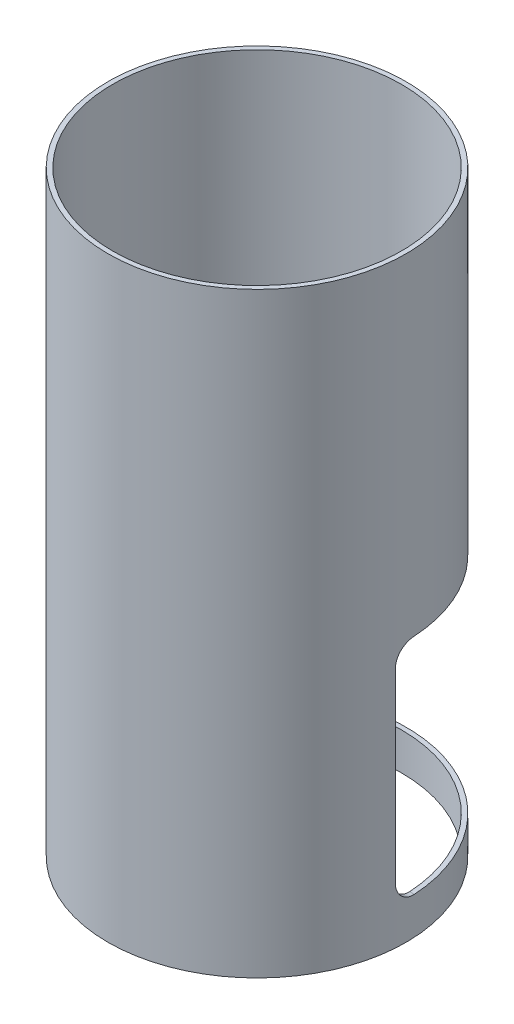
ISO-10303-21;
HEADER;
FILE_DESCRIPTION(('STEP AP214'),'2;1');
FILE_NAME('part.step','',(''),(''),'','','');
FILE_SCHEMA(('AUTOMOTIVE_DESIGN { 1 0 10303 214 1 1 1 1 }'));
ENDSEC;
DATA;
#1=APPLICATION_CONTEXT('core data for automotive mechanical design processes');
#2=APPLICATION_PROTOCOL_DEFINITION('international standard','automotive_design',2000,#1);
#3=PRODUCT_CONTEXT('',#1,'mechanical');
#4=PRODUCT('Part','Part','',(#3));
#5=PRODUCT_RELATED_PRODUCT_CATEGORY('part','',(#4));
#6=PRODUCT_DEFINITION_FORMATION('','',#4);
#7=PRODUCT_DEFINITION_CONTEXT('part definition',#1,'design');
#8=PRODUCT_DEFINITION('design','',#6,#7);
#9=PRODUCT_DEFINITION_SHAPE('','',#8);
#10=(LENGTH_UNIT() NAMED_UNIT(*) SI_UNIT(.MILLI.,.METRE.));
#11=(NAMED_UNIT(*) PLANE_ANGLE_UNIT() SI_UNIT($,.RADIAN.));
#12=(NAMED_UNIT(*) SI_UNIT($,.STERADIAN.) SOLID_ANGLE_UNIT());
#13=UNCERTAINTY_MEASURE_WITH_UNIT(LENGTH_MEASURE(1.E-05),#10,'distance_accuracy_value','');
#14=(GEOMETRIC_REPRESENTATION_CONTEXT(3) GLOBAL_UNCERTAINTY_ASSIGNED_CONTEXT((#13)) GLOBAL_UNIT_ASSIGNED_CONTEXT((#10,
#11,#12)) REPRESENTATION_CONTEXT('',''));
#15=CARTESIAN_POINT('',(0.,0.,0.));
#16=DIRECTION('',(0.,0.,1.));
#17=DIRECTION('',(1.,0.,0.));
#18=AXIS2_PLACEMENT_3D('',#15,#16,#17);
#19=CARTESIAN_POINT('',(0.,406.4,0.));
#20=DIRECTION('',(0.,1.,0.));
#21=DIRECTION('',(0.,0.,1.));
#22=AXIS2_PLACEMENT_3D('',#19,#20,#21);
#23=PLANE('',#22);
#24=CARTESIAN_POINT('',(0.,406.4,0.));
#25=DIRECTION('',(0.,1.,0.));
#26=DIRECTION('',(0.,0.,1.));
#27=AXIS2_PLACEMENT_3D('',#24,#25,#26);
#28=CIRCLE('',#27,101.6);
#29=CARTESIAN_POINT('',(0.,406.4,101.6));
#30=VERTEX_POINT('',#29);
#31=EDGE_CURVE('E136',#30,#30,#28,.T.);
#32=ORIENTED_EDGE('',*,*,#31,.T.);
#33=EDGE_LOOP('',(#32));
#34=FACE_BOUND('',#33,.T.);
#35=CARTESIAN_POINT('',(0.,406.4,0.));
#36=DIRECTION('',(0.,1.,0.));
#37=DIRECTION('',(0.,0.,1.));
#38=AXIS2_PLACEMENT_3D('',#35,#36,#37);
#39=CIRCLE('',#38,98.425);
#40=CARTESIAN_POINT('',(0.,406.4,98.425));
#41=VERTEX_POINT('',#40);
#42=EDGE_CURVE('E235',#41,#41,#39,.T.);
#43=ORIENTED_EDGE('',*,*,#42,.F.);
#44=EDGE_LOOP('',(#43));
#45=FACE_BOUND('',#44,.T.);
#46=ADVANCED_FACE('F39',(#34,#45),#23,.T.);
#47=CARTESIAN_POINT('',(0.,0.,0.));
#48=DIRECTION('',(0.,1.,0.));
#49=DIRECTION('',(0.,0.,1.));
#50=AXIS2_PLACEMENT_3D('',#47,#48,#49);
#51=PLANE('',#50);
#52=CARTESIAN_POINT('',(0.,0.,0.));
#53=DIRECTION('',(0.,1.,0.));
#54=DIRECTION('',(0.,0.,1.));
#55=AXIS2_PLACEMENT_3D('',#52,#53,#54);
#56=CIRCLE('',#55,101.6);
#57=CARTESIAN_POINT('',(0.,0.,101.6));
#58=VERTEX_POINT('',#57);
#59=EDGE_CURVE('E141',#58,#58,#56,.T.);
#60=ORIENTED_EDGE('',*,*,#59,.F.);
#61=EDGE_LOOP('',(#60));
#62=FACE_BOUND('',#61,.T.);
#63=CARTESIAN_POINT('',(0.,0.,0.));
#64=DIRECTION('',(0.,1.,0.));
#65=DIRECTION('',(0.,0.,1.));
#66=AXIS2_PLACEMENT_3D('',#63,#64,#65);
#67=CIRCLE('',#66,98.425);
#68=CARTESIAN_POINT('',(0.,0.,98.425));
#69=VERTEX_POINT('',#68);
#70=EDGE_CURVE('E232',#69,#69,#67,.T.);
#71=ORIENTED_EDGE('',*,*,#70,.T.);
#72=EDGE_LOOP('',(#71));
#73=FACE_BOUND('',#72,.T.);
#74=ADVANCED_FACE('F245',(#62,#73),#51,.F.);
#75=CARTESIAN_POINT('',(0.,406.4,0.));
#76=DIRECTION('',(0.,-1.,0.));
#77=DIRECTION('',(0.,0.,-1.));
#78=AXIS2_PLACEMENT_3D('',#75,#76,#77);
#79=CYLINDRICAL_SURFACE('',#78,101.6);
#80=DIRECTION('',(0.,-1.,0.));
#81=VECTOR('',#80,1.);
#82=CARTESIAN_POINT('',(101.352507506398,177.8,7.0872577324035));
#83=LINE('',#82,#81);
#84=CARTESIAN_POINT('',(101.352507506398,165.1,7.0872577324035));
#85=VERTEX_POINT('',#84);
#86=CARTESIAN_POINT('',(101.352507506398,38.1000000000001,7.0872577324035));
#87=VERTEX_POINT('',#86);
#88=EDGE_CURVE('E131',#85,#87,#83,.T.);
#89=ORIENTED_EDGE('',*,*,#88,.F.);
#90=CARTESIAN_POINT('',(101.352507506398,165.1,7.0872577324035));
#91=CARTESIAN_POINT('',(101.352490680105,165.457145711755,7.08729503529065));
#92=CARTESIAN_POINT('',(101.353557853474,165.814285914696,7.07223068436696));
#93=CARTESIAN_POINT('',(101.357738604548,166.526012081259,7.0121680785598));
#94=CARTESIAN_POINT('',(101.360852085439,166.880598164919,6.96717123982882));
#95=CARTESIAN_POINT('',(101.369000908904,167.584450688851,6.84755659702855));
#96=CARTESIAN_POINT('',(101.374034849857,167.933720816036,6.77296039407447));
#97=CARTESIAN_POINT('',(101.385789336181,168.624721514362,6.59467575024478));
#98=CARTESIAN_POINT('',(101.392509860944,168.966452177575,6.49098766484647));
#99=CARTESIAN_POINT('',(101.407330688748,169.640117750323,6.25517540473336));
#100=CARTESIAN_POINT('',(101.415431675931,169.97204770657,6.12303712180545));
#101=CARTESIAN_POINT('',(101.432625869236,170.623572347981,5.83127382370409));
#102=CARTESIAN_POINT('',(101.441719074595,170.943167042617,5.67164882963567));
#103=CARTESIAN_POINT('',(101.460450835278,171.567692534275,5.32605301537648));
#104=CARTESIAN_POINT('',(101.470089298308,171.872625796881,5.14008664586342));
#105=CARTESIAN_POINT('',(101.489421043065,172.465710833294,4.74308905799296));
#106=CARTESIAN_POINT('',(101.499114324457,172.753862709487,4.53205799258293));
#107=CARTESIAN_POINT('',(101.518026386225,173.311146290048,4.08656009304685));
#108=CARTESIAN_POINT('',(101.52724547585,173.580290434373,3.85210883392709));
#109=CARTESIAN_POINT('',(101.544679270725,174.097849583408,3.36130781304116));
#110=CARTESIAN_POINT('',(101.55289397125,174.346264490607,3.10495794827525));
#111=CARTESIAN_POINT('',(101.567785695279,174.820625983605,2.57214446746383));
#112=CARTESIAN_POINT('',(101.574462504866,175.046569441209,2.2956780602954));
#113=CARTESIAN_POINT('',(101.585762448801,175.474338927299,1.72464490901471));
#114=CARTESIAN_POINT('',(101.590385618321,175.676165368803,1.43007847500752));
#115=CARTESIAN_POINT('',(101.597092624483,176.053796153326,0.825733138629053));
#116=CARTESIAN_POINT('',(101.599182925293,176.229665728394,0.515995069276033));
#117=CARTESIAN_POINT('',(101.600425660314,176.554778225901,-0.117158431350992));
#118=CARTESIAN_POINT('',(101.599578070693,176.70402093234,-0.440573973551779));
#119=CARTESIAN_POINT('',(101.594592131139,176.974814937986,-1.09864532448756));
#120=CARTESIAN_POINT('',(101.59045500717,177.096376531861,-1.43329690121104));
#121=CARTESIAN_POINT('',(101.578625080404,177.311053176135,-2.11140284865901));
#122=CARTESIAN_POINT('',(101.570933088515,177.404174706003,-2.45485519495734));
#123=CARTESIAN_POINT('',(101.548526079264,177.588332354327,-3.26695272091826));
#124=CARTESIAN_POINT('',(101.532309232997,177.667776809299,-3.73826465716463));
#125=CARTESIAN_POINT('',(101.502830200809,177.74714043693,-4.4487994877028));
#126=CARTESIAN_POINT('',(101.49215277868,177.766961156985,-4.68609667339186));
#127=CARTESIAN_POINT('',(101.469092342687,177.793390907594,-5.1613892389719));
#128=CARTESIAN_POINT('',(101.456709001795,177.799997401175,-5.39938474414999));
#129=CARTESIAN_POINT('',(101.443480822077,177.8,-5.63739289929005));
#130=B_SPLINE_CURVE_WITH_KNOTS('',3,(#90,#91,#92,#93,#94,#95,#96,#97,#98,#99,#100,#101,#102,
#103,#104,#105,#106,#107,#108,#109,#110,#111,#112,#113,#114,#115,#116,#117,#118,#119,#120,#121,
#122,#123,#124,#125,#126,#127,#128,#129),.UNSPECIFIED.,.F.,.F.,(4,2,2,2,2,2,2,2,2,2,2,2,2,2,2,2,
2,2,2,4),(0.,1.07111020816663,2.1421697440494,3.21244907217267,4.28271532299071,
5.35351353725705,6.42431092933955,7.4949276132491,8.56553776448018,9.63544061443254,
10.7053484969324,11.7754051107428,12.8454433965412,13.9127450320036,14.9800553251362,
16.046968032514,17.1136374846756,18.5448903135323,19.2596666782446,19.9745802583073),.UNSPECIFIED.);
#131=CARTESIAN_POINT('',(101.443480822077,177.8,-5.63739289929006));
#132=VERTEX_POINT('',#131);
#133=EDGE_CURVE('E53',#85,#132,#130,.T.);
#134=ORIENTED_EDGE('',*,*,#133,.T.);
#135=CARTESIAN_POINT('',(0.,177.8,0.));
#136=DIRECTION('',(0.,1.,0.));
#137=DIRECTION('',(0.,0.,1.));
#138=AXIS2_PLACEMENT_3D('',#135,#136,#137);
#139=CIRCLE('',#138,101.6);
#140=CARTESIAN_POINT('',(-101.443480822077,177.8,-5.63739289929006));
#141=VERTEX_POINT('',#140);
#142=EDGE_CURVE('E115',#132,#141,#139,.T.);
#143=ORIENTED_EDGE('',*,*,#142,.T.);
#144=CARTESIAN_POINT('',(-101.443480822077,177.8,-5.63739289929006));
#145=CARTESIAN_POINT('',(-101.463304318896,177.800039069962,-5.28101074959956));
#146=CARTESIAN_POINT('',(-101.481213332903,177.785189316922,-4.92451825425865));
#147=CARTESIAN_POINT('',(-101.513196800821,177.725870463819,-4.21383249727284));
#148=CARTESIAN_POINT('',(-101.527271244402,177.681401283958,-3.85963924182487));
#149=CARTESIAN_POINT('',(-101.551572059362,177.563039921353,-3.15629990412808));
#150=CARTESIAN_POINT('',(-101.561800897827,177.48916666516,-2.80715072467401));
#151=CARTESIAN_POINT('',(-101.578546584507,177.312439686108,-2.11618399513467));
#152=CARTESIAN_POINT('',(-101.585063538039,177.209586785601,-1.77436623730259));
#153=CARTESIAN_POINT('',(-101.594601989376,176.975462059296,-1.10026700487742));
#154=CARTESIAN_POINT('',(-101.597620866012,176.84416901012,-0.767992863050888));
#155=CARTESIAN_POINT('',(-101.600457773882,176.554088593483,-0.115656989504371));
#156=CARTESIAN_POINT('',(-101.600275811019,176.395301276728,0.204404764737226));
#157=CARTESIAN_POINT('',(-101.597091723552,176.051369371343,0.829919660992572));
#158=CARTESIAN_POINT('',(-101.594090304819,175.866231389626,1.13537643934836));
#159=CARTESIAN_POINT('',(-101.585712185619,175.470868112356,1.72955985099311));
#160=CARTESIAN_POINT('',(-101.580335507065,175.260643048254,2.01828663859453));
#161=CARTESIAN_POINT('',(-101.567724800087,174.817502768789,2.57579592301461));
#162=CARTESIAN_POINT('',(-101.560498455684,174.584683840953,2.84465513918334));
#163=CARTESIAN_POINT('',(-101.544695038223,174.097283570891,3.36182339568089));
#164=CARTESIAN_POINT('',(-101.5361179615,173.842702169633,3.61013238026211));
#165=CARTESIAN_POINT('',(-101.518142112432,173.313518903318,4.08450639764461));
#166=CARTESIAN_POINT('',(-101.508743152751,173.038912476246,4.31056633402936));
#167=CARTESIAN_POINT('',(-101.489653582352,172.471679077097,4.73879402899632));
#168=CARTESIAN_POINT('',(-101.479962975238,172.179052327774,4.94096208282351));
#169=CARTESIAN_POINT('',(-101.460779690977,171.577259898905,5.32037147042846));
#170=CARTESIAN_POINT('',(-101.451287434448,171.268063224448,5.49756366760062));
#171=CARTESIAN_POINT('',(-101.432995354641,170.635847827433,5.82532453211955));
#172=CARTESIAN_POINT('',(-101.424195538585,170.312828960754,5.97589292178117));
#173=CARTESIAN_POINT('',(-101.407716649044,169.655387843722,6.24930230321614));
#174=CARTESIAN_POINT('',(-101.400037082344,169.320970692227,6.3721555103583));
#175=CARTESIAN_POINT('',(-101.386154787376,168.64310906164,6.58934081551105));
#176=CARTESIAN_POINT('',(-101.379951723254,168.299666655274,6.6836794009856));
#177=CARTESIAN_POINT('',(-101.367456788158,167.485180741489,6.87099739083214));
#178=CARTESIAN_POINT('',(-101.361884613855,167.011308111906,6.95208875834734));
#179=CARTESIAN_POINT('',(-101.356277830897,166.296515569402,7.03317504777537));
#180=CARTESIAN_POINT('',(-101.354867502864,166.057715058771,7.05344533059619));
#181=CARTESIAN_POINT('',(-101.352981299351,165.579297289201,7.08048667541715));
#182=CARTESIAN_POINT('',(-101.352505618409,165.339679870623,7.08725492707371));
#183=CARTESIAN_POINT('',(-101.352507506398,165.1,7.08725773240349));
#184=B_SPLINE_CURVE_WITH_KNOTS('',3,(#144,#145,#146,#147,#148,#149,#150,#151,#152,#153,#154,
#155,#156,#157,#158,#159,#160,#161,#162,#163,#164,#165,#166,#167,#168,#169,#170,#171,#172,#173,
#174,#175,#176,#177,#178,#179,#180,#181,#182,#183),.UNSPECIFIED.,.F.,.F.,(4,2,2,2,2,2,2,2,2,2,2,
2,2,2,2,2,2,2,2,4),(0.,1.07049125834571,2.14098540069004,3.21079160842633,4.28056746144515,
5.35114439881777,6.42171936177898,7.49202637032659,8.56232350510861,9.62824452152936,
10.6941684294305,11.7603359347369,12.8264902634545,13.894713673364,14.9629482241407,
16.0307110304491,17.0982307230337,18.5370921201497,19.2557615180968,19.9745804859318),.UNSPECIFIED.);
#185=CARTESIAN_POINT('',(-101.352507506398,165.1,7.0872577324035));
#186=VERTEX_POINT('',#185);
#187=EDGE_CURVE('E109',#141,#186,#184,.T.);
#188=ORIENTED_EDGE('',*,*,#187,.T.);
#189=DIRECTION('',(0.,-1.,0.));
#190=VECTOR('',#189,1.);
#191=CARTESIAN_POINT('',(-101.352507506398,177.8,7.0872577324035));
#192=LINE('',#191,#190);
#193=CARTESIAN_POINT('',(-101.352507506398,38.1000000000001,7.0872577324035));
#194=VERTEX_POINT('',#193);
#195=EDGE_CURVE('E113',#186,#194,#192,.T.);
#196=ORIENTED_EDGE('',*,*,#195,.T.);
#197=CARTESIAN_POINT('',(-101.352507506398,38.1,7.0872577324035));
#198=CARTESIAN_POINT('',(-101.352490680105,37.7428542882449,7.08729503529065));
#199=CARTESIAN_POINT('',(-101.353557853474,37.385714085304,7.07223068436696));
#200=CARTESIAN_POINT('',(-101.357738604548,36.6739879187407,7.0121680785598));
#201=CARTESIAN_POINT('',(-101.360852085439,36.319401835081,6.96717123982882));
#202=CARTESIAN_POINT('',(-101.369000908904,35.6155493111487,6.84755659702855));
#203=CARTESIAN_POINT('',(-101.374034849857,35.266279183964,6.77296039407447));
#204=CARTESIAN_POINT('',(-101.385789336181,34.5752784856376,6.59467575024479));
#205=CARTESIAN_POINT('',(-101.392509860944,34.2335478224254,6.49098766484648));
#206=CARTESIAN_POINT('',(-101.407330688748,33.5598822496768,6.25517540473336));
#207=CARTESIAN_POINT('',(-101.415431675931,33.22795229343,6.12303712180546));
#208=CARTESIAN_POINT('',(-101.432625869236,32.5764276520186,5.8312738237041));
#209=CARTESIAN_POINT('',(-101.441719074595,32.2568329573829,5.67164882963567));
#210=CARTESIAN_POINT('',(-101.460450835278,31.6323074657246,5.32605301537649));
#211=CARTESIAN_POINT('',(-101.470089298308,31.3273742031192,5.14008664586343));
#212=CARTESIAN_POINT('',(-101.489421043065,30.7342891667062,4.74308905799297));
#213=CARTESIAN_POINT('',(-101.499114324457,30.4461372905129,4.53205799258294));
#214=CARTESIAN_POINT('',(-101.518026386225,29.8888537099518,4.08656009304685));
#215=CARTESIAN_POINT('',(-101.52724547585,29.619709565627,3.85210883392711));
#216=CARTESIAN_POINT('',(-101.544679270725,29.1021504165923,3.36130781304117));
#217=CARTESIAN_POINT('',(-101.55289397125,28.8537355093927,3.10495794827526));
#218=CARTESIAN_POINT('',(-101.567785695279,28.3793740163951,2.57214446746383));
#219=CARTESIAN_POINT('',(-101.574462504866,28.1534305587906,2.29567806029541));
#220=CARTESIAN_POINT('',(-101.585762448801,27.7256610727011,1.72464490901472));
#221=CARTESIAN_POINT('',(-101.590385618321,27.5238346311971,1.43007847500752));
#222=CARTESIAN_POINT('',(-101.597092624483,27.1462038466743,0.825733138629051));
#223=CARTESIAN_POINT('',(-101.599182925293,26.9703342716059,0.515995069276032));
#224=CARTESIAN_POINT('',(-101.600425660314,26.645221774099,-0.117158431350995));
#225=CARTESIAN_POINT('',(-101.599578070693,26.4959790676603,-0.440573973551784));
#226=CARTESIAN_POINT('',(-101.594592131139,26.2251850620145,-1.09864532448756));
#227=CARTESIAN_POINT('',(-101.59045500717,26.103623468139,-1.43329690121104));
#228=CARTESIAN_POINT('',(-101.578625080404,25.8889468238651,-2.11140284865902));
#229=CARTESIAN_POINT('',(-101.570933088515,25.7958252939974,-2.45485519495734));
#230=CARTESIAN_POINT('',(-101.548526079264,25.6116676456728,-3.26695272091826));
#231=CARTESIAN_POINT('',(-101.532309232997,25.532223190701,-3.73826465716463));
#232=CARTESIAN_POINT('',(-101.502830200809,25.4528595630697,-4.4487994877028));
#233=CARTESIAN_POINT('',(-101.49215277868,25.4330388430154,-4.68609667339187));
#234=CARTESIAN_POINT('',(-101.469092342687,25.4066090924062,-5.1613892389719));
#235=CARTESIAN_POINT('',(-101.456709001795,25.4000025988249,-5.39938474415));
#236=CARTESIAN_POINT('',(-101.443480822077,25.4,-5.63739289929006));
#237=B_SPLINE_CURVE_WITH_KNOTS('',3,(#197,#198,#199,#200,#201,#202,#203,#204,#205,#206,#207,
#208,#209,#210,#211,#212,#213,#214,#215,#216,#217,#218,#219,#220,#221,#222,#223,#224,#225,#226,
#227,#228,#229,#230,#231,#232,#233,#234,#235,#236),.UNSPECIFIED.,.F.,.F.,(4,2,2,2,2,2,2,2,2,2,2,
2,2,2,2,2,2,2,2,4),(0.,1.07111020816662,2.14216974404938,3.21244907217265,4.2827153229907,
5.35351353725703,6.42431092933952,7.49492761324908,8.56553776448015,9.63544061443252,
10.7053484969323,11.7754051107428,12.8454433965412,13.9127450320036,14.9800553251362,
16.046968032514,17.1136374846756,18.5448903135323,19.2596666782446,19.9745802583073),.UNSPECIFIED.);
#238=CARTESIAN_POINT('',(-101.443480822077,25.4,-5.63739289929006));
#239=VERTEX_POINT('',#238);
#240=EDGE_CURVE('E157',#194,#239,#237,.T.);
#241=ORIENTED_EDGE('',*,*,#240,.T.);
#242=CARTESIAN_POINT('',(0.,25.4,0.));
#243=DIRECTION('',(0.,1.,0.));
#244=DIRECTION('',(0.,0.,1.));
#245=AXIS2_PLACEMENT_3D('',#242,#243,#244);
#246=CIRCLE('',#245,101.6);
#247=CARTESIAN_POINT('',(101.443480822077,25.4,-5.63739289929006));
#248=VERTEX_POINT('',#247);
#249=EDGE_CURVE('E346',#248,#239,#246,.T.);
#250=ORIENTED_EDGE('',*,*,#249,.F.);
#251=CARTESIAN_POINT('',(101.443480822077,25.4,-5.63739289929006));
#252=CARTESIAN_POINT('',(101.463304318896,25.3999609300383,-5.28101074959956));
#253=CARTESIAN_POINT('',(101.481213332903,25.4148106830776,-4.92451825425865));
#254=CARTESIAN_POINT('',(101.513196800821,25.4741295361808,-4.21383249727284));
#255=CARTESIAN_POINT('',(101.527271244402,25.5185987160418,-3.85963924182487));
#256=CARTESIAN_POINT('',(101.551572059362,25.6369600786465,-3.15629990412808));
#257=CARTESIAN_POINT('',(101.561800897827,25.7108333348399,-2.80715072467401));
#258=CARTESIAN_POINT('',(101.578546584507,25.887560313892,-2.11618399513467));
#259=CARTESIAN_POINT('',(101.585063538039,25.9904132143987,-1.77436623730259));
#260=CARTESIAN_POINT('',(101.594601989376,26.2245379407037,-1.10026700487741));
#261=CARTESIAN_POINT('',(101.597620866012,26.3558309898798,-0.767992863050872));
#262=CARTESIAN_POINT('',(101.600457773882,26.6459114065175,-0.115656989504351));
#263=CARTESIAN_POINT('',(101.600275811019,26.8046987232722,0.204404764737243));
#264=CARTESIAN_POINT('',(101.597091723552,27.1486306286575,0.829919660992589));
#265=CARTESIAN_POINT('',(101.594090304819,27.3337686103743,1.13537643934838));
#266=CARTESIAN_POINT('',(101.585712185619,27.7291318876438,1.72955985099312));
#267=CARTESIAN_POINT('',(101.580335507065,27.9393569517461,2.01828663859454));
#268=CARTESIAN_POINT('',(101.567724800087,28.3824972312108,2.57579592301461));
#269=CARTESIAN_POINT('',(101.560498455684,28.6153161590472,2.84465513918335));
#270=CARTESIAN_POINT('',(101.544695038223,29.1027164291094,3.3618233956809));
#271=CARTESIAN_POINT('',(101.5361179615,29.3572978303674,3.61013238026212));
#272=CARTESIAN_POINT('',(101.518142112432,29.8864810966822,4.08450639764463));
#273=CARTESIAN_POINT('',(101.508743152751,30.1610875237537,4.31056633402938));
#274=CARTESIAN_POINT('',(101.489653582352,30.7283209229033,4.73879402899634));
#275=CARTESIAN_POINT('',(101.479962975238,31.0209476722265,4.94096208282352));
#276=CARTESIAN_POINT('',(101.460779690977,31.6227401010952,5.32037147042847));
#277=CARTESIAN_POINT('',(101.451287434448,31.9319367755524,5.49756366760062));
#278=CARTESIAN_POINT('',(101.432995354641,32.5641521725671,5.82532453211956));
#279=CARTESIAN_POINT('',(101.424195538585,32.8871710392459,5.97589292178117));
#280=CARTESIAN_POINT('',(101.407716649044,33.5446121562784,6.24930230321614));
#281=CARTESIAN_POINT('',(101.400037082344,33.8790293077734,6.3721555103583));
#282=CARTESIAN_POINT('',(101.386154787376,34.5568909383596,6.58934081551105));
#283=CARTESIAN_POINT('',(101.379951723254,34.9003333447259,6.68367940098559));
#284=CARTESIAN_POINT('',(101.367456788158,35.7148192585114,6.87099739083214));
#285=CARTESIAN_POINT('',(101.361884613855,36.1886918880943,6.95208875834735));
#286=CARTESIAN_POINT('',(101.356277830897,36.903484430598,7.03317504777538));
#287=CARTESIAN_POINT('',(101.354867502864,37.1422849412292,7.05344533059619));
#288=CARTESIAN_POINT('',(101.352981299351,37.6207027107994,7.08048667541714));
#289=CARTESIAN_POINT('',(101.352505618409,37.8603201293771,7.08725492707371));
#290=CARTESIAN_POINT('',(101.352507506398,38.1,7.0872577324035));
#291=B_SPLINE_CURVE_WITH_KNOTS('',3,(#251,#252,#253,#254,#255,#256,#257,#258,#259,#260,#261,
#262,#263,#264,#265,#266,#267,#268,#269,#270,#271,#272,#273,#274,#275,#276,#277,#278,#279,#280,
#281,#282,#283,#284,#285,#286,#287,#288,#289,#290),.UNSPECIFIED.,.F.,.F.,(4,2,2,2,2,2,2,2,2,2,2,
2,2,2,2,2,2,2,2,4),(0.,1.07049125834571,2.14098540069004,3.21079160842633,4.28056746144515,
5.3511443988178,6.421719361779,7.4920263703266,8.5623235051086,9.62824452152937,
10.6941684294305,11.7603359347369,12.8264902634545,13.894713673364,14.9629482241407,
16.0307110304491,17.0982307230337,18.5370921201497,19.2557615180968,19.9745804859318),.UNSPECIFIED.);
#292=EDGE_CURVE('E60',#248,#87,#291,.T.);
#293=ORIENTED_EDGE('',*,*,#292,.T.);
#294=EDGE_LOOP('',(#89,#134,#143,#188,#196,#241,#250,#293));
#295=FACE_BOUND('',#294,.T.);
#296=ORIENTED_EDGE('',*,*,#31,.F.);
#297=EDGE_LOOP('',(#296));
#298=FACE_BOUND('',#297,.T.);
#299=ORIENTED_EDGE('',*,*,#59,.T.);
#300=EDGE_LOOP('',(#299));
#301=FACE_BOUND('',#300,.T.);
#302=ADVANCED_FACE('F111',(#295,#298,#301),#79,.T.);
#303=CARTESIAN_POINT('',(0.,406.4,0.));
#304=DIRECTION('',(0.,-1.,0.));
#305=DIRECTION('',(0.,0.,-1.));
#306=AXIS2_PLACEMENT_3D('',#303,#304,#305);
#307=CYLINDRICAL_SURFACE('',#306,98.425);
#308=CARTESIAN_POINT('',(0.,177.8,0.));
#309=DIRECTION('',(0.,1.,0.));
#310=DIRECTION('',(0.,0.,1.));
#311=AXIS2_PLACEMENT_3D('',#308,#309,#310);
#312=CIRCLE('',#311,98.425);
#313=CARTESIAN_POINT('',(98.2503591938578,177.8,-5.86067771489929));
#314=VERTEX_POINT('',#313);
#315=CARTESIAN_POINT('',(-98.2503591938578,177.8,-5.86067771489928));
#316=VERTEX_POINT('',#315);
#317=EDGE_CURVE('E222',#314,#316,#312,.T.);
#318=ORIENTED_EDGE('',*,*,#317,.F.);
#319=CARTESIAN_POINT('',(98.2503591938578,177.8,-5.86067771489928));
#320=CARTESIAN_POINT('',(98.2716308233536,177.800039109309,-5.50439656803708));
#321=CARTESIAN_POINT('',(98.2909269510806,177.785206177048,-5.14799301866223));
#322=CARTESIAN_POINT('',(98.3255565945146,177.725946788467,-4.43745940439693));
#323=CARTESIAN_POINT('',(98.3408900865399,177.681520155294,-4.08332935310583));
#324=CARTESIAN_POINT('',(98.3675741186761,177.563261495093,-3.38008874609604));
#325=CARTESIAN_POINT('',(98.3789271823774,177.489448162857,-3.03097514510128));
#326=CARTESIAN_POINT('',(98.397785142794,177.312852003523,-2.34005701861029));
#327=CARTESIAN_POINT('',(98.4052901527148,177.21007002879,-1.99825227837885));
#328=CARTESIAN_POINT('',(98.4166703097868,176.97609058271,-1.32415344801447));
#329=CARTESIAN_POINT('',(98.4205426725783,176.844871409429,-0.991866842165396));
#330=CARTESIAN_POINT('',(98.4249550867022,176.554938989275,-0.339490325326498));
#331=CARTESIAN_POINT('',(98.4254951446418,176.396225796919,-0.0194003901542068));
#332=CARTESIAN_POINT('',(98.4236303000176,176.052440381717,0.606181158343379));
#333=CARTESIAN_POINT('',(98.42122614934,175.867374899332,0.911676478115657));
#334=CARTESIAN_POINT('',(98.4139272257001,175.472152599629,1.50594545793266));
#335=CARTESIAN_POINT('',(98.409032476336,175.261996020063,1.79471927638441));
#336=CARTESIAN_POINT('',(98.3972812314928,174.819046615044,2.35225384152859));
#337=CARTESIAN_POINT('',(98.3904333710454,174.586356341551,2.62109625772406));
#338=CARTESIAN_POINT('',(98.3752965633528,174.099219496857,3.13824601242546));
#339=CARTESIAN_POINT('',(98.3670076124466,173.844772870388,3.3865532987602));
#340=CARTESIAN_POINT('',(98.3495304510153,173.315863345203,3.86093953816894));
#341=CARTESIAN_POINT('',(98.3403420338055,173.041395849681,4.0870133582667));
#342=CARTESIAN_POINT('',(98.3216089674565,172.474443319933,4.51528449633961));
#343=CARTESIAN_POINT('',(98.3120643226516,172.181958504898,4.71748210469709));
#344=CARTESIAN_POINT('',(98.293120435601,171.580418195411,5.09698815098505));
#345=CARTESIAN_POINT('',(98.2837215318525,171.271329934359,5.27424467308844));
#346=CARTESIAN_POINT('',(98.2655767012571,170.639327973995,5.60214554144258));
#347=CARTESIAN_POINT('',(98.2568307813325,170.316414128172,5.75278960559146));
#348=CARTESIAN_POINT('',(98.2404314863995,169.65917759439,6.02636237006173));
#349=CARTESIAN_POINT('',(98.232777632727,169.324859984931,6.14930322676118));
#350=CARTESIAN_POINT('',(98.2189283095058,168.647191197027,6.36667585659107));
#351=CARTESIAN_POINT('',(98.2127325095371,168.303842084922,6.4611140902768));
#352=CARTESIAN_POINT('',(98.2002302524855,167.488772693876,6.64886280622892));
#353=CARTESIAN_POINT('',(98.1946446408134,167.014198405046,6.73020050762315));
#354=CARTESIAN_POINT('',(98.1890230506216,166.29833329598,6.81153345765535));
#355=CARTESIAN_POINT('',(98.1876086789198,166.059171398477,6.83186548730636));
#356=CARTESIAN_POINT('',(98.1857168966193,165.580027368949,6.85898921119962));
#357=CARTESIAN_POINT('',(98.1852396806995,165.34004507687,6.86577809207525));
#358=CARTESIAN_POINT('',(98.1852416468232,165.1,6.86578092826589));
#359=B_SPLINE_CURVE_WITH_KNOTS('',3,(#319,#320,#321,#322,#323,#324,#325,#326,#327,#328,#329,
#330,#331,#332,#333,#334,#335,#336,#337,#338,#339,#340,#341,#342,#343,#344,#345,#346,#347,#348,
#349,#350,#351,#352,#353,#354,#355,#356,#357,#358),.UNSPECIFIED.,.F.,.F.,(4,2,2,2,2,2,2,2,2,2,2,
2,2,2,2,2,2,2,2,4),(0.,1.07044008433151,2.14088656574488,3.21065315190167,4.28038826488447,
5.35094264250373,6.42149489741283,7.49177381376062,8.56204258942545,9.62765098882547,
10.6932620954085,11.759118641864,12.8249622240439,13.8929925797138,14.9610342562207,
16.0286063512956,17.0959362827863,18.5369806335441,19.2567446136961,19.9766580974238),.UNSPECIFIED.);
#360=CARTESIAN_POINT('',(98.1852416468232,165.1,6.86578092826589));
#361=VERTEX_POINT('',#360);
#362=EDGE_CURVE('E11',#314,#361,#359,.T.);
#363=ORIENTED_EDGE('',*,*,#362,.T.);
#364=DIRECTION('',(0.,-1.,0.));
#365=VECTOR('',#364,1.);
#366=CARTESIAN_POINT('',(98.1852416468232,177.8,6.86578092826589));
#367=LINE('',#366,#365);
#368=CARTESIAN_POINT('',(98.1852416468232,38.1000000000001,6.86578092826589));
#369=VERTEX_POINT('',#368);
#370=EDGE_CURVE('E228',#361,#369,#367,.T.);
#371=ORIENTED_EDGE('',*,*,#370,.T.);
#372=CARTESIAN_POINT('',(98.1852416468232,38.1,6.86578092826589));
#373=CARTESIAN_POINT('',(98.1852243648159,37.7428579075801,6.8658181977252));
#374=CARTESIAN_POINT('',(98.1862919582897,37.3857213234644,6.85075418373783));
#375=CARTESIAN_POINT('',(98.1904720077305,36.6740023021945,6.79069274974572));
#376=CARTESIAN_POINT('',(98.1935843670445,36.3194197451164,6.74569674457799));
#377=CARTESIAN_POINT('',(98.2017261223854,35.6155734961624,6.62608391747099));
#378=CARTESIAN_POINT('',(98.206754123709,35.2663061264471,6.55148864395411));
#379=CARTESIAN_POINT('',(98.2184855478379,34.5753107650612,6.37320555031406));
#380=CARTESIAN_POINT('',(98.2251889501698,34.2335826813163,6.26951808569469));
#381=CARTESIAN_POINT('',(98.2399559854041,33.5599218737531,6.03370610232214));
#382=CARTESIAN_POINT('',(98.2480202936046,33.2279941095209,5.90156745672457));
#383=CARTESIAN_POINT('',(98.2651112686217,32.576473798176,5.60980186392919));
#384=CARTESIAN_POINT('',(98.2741379346373,32.2568812407952,5.45017493961369));
#385=CARTESIAN_POINT('',(98.2926949630539,31.6323600682275,5.10457302411561));
#386=CARTESIAN_POINT('',(98.3022252403582,31.3274289921727,4.91860247542328));
#387=CARTESIAN_POINT('',(98.3212860498772,30.7343488734004,4.52159391564327));
#388=CARTESIAN_POINT('',(98.3308165820901,30.4461997275035,4.31055605869964));
#389=CARTESIAN_POINT('',(98.3493347861753,29.8889345385108,3.86505142988613));
#390=CARTESIAN_POINT('',(98.3583228351092,29.619805252597,3.63060123914825));
#391=CARTESIAN_POINT('',(98.3752130442336,29.1022755773647,3.13980202893722));
#392=CARTESIAN_POINT('',(98.3831151993612,28.8538752846985,2.88345290736801));
#393=CARTESIAN_POINT('',(98.3972871364018,28.3795439537781,2.35064267881174));
#394=CARTESIAN_POINT('',(98.4035566978446,28.1536159527901,2.07417886192117));
#395=CARTESIAN_POINT('',(98.4139353928516,27.7258770520129,1.50315354240798));
#396=CARTESIAN_POINT('',(98.4180445636671,27.524065736429,1.20859235193391));
#397=CARTESIAN_POINT('',(98.423607176832,27.1464980948834,0.604317152858124));
#398=CARTESIAN_POINT('',(98.425067858117,26.9706719588438,0.294646830426171));
#399=CARTESIAN_POINT('',(98.4249272887234,26.6456337609579,-0.338358344992233));
#400=CARTESIAN_POINT('',(98.4233260131565,26.4964219154481,-0.661693309026398));
#401=CARTESIAN_POINT('',(98.4167029789701,26.2256728791442,-1.31959072821588));
#402=CARTESIAN_POINT('',(98.4116824726579,26.1041255778337,-1.65414903013939));
#403=CARTESIAN_POINT('',(98.3979532231811,25.8894575035571,-2.33205182015103));
#404=CARTESIAN_POINT('',(98.3892453181986,25.7963302786993,-2.67539429485536));
#405=CARTESIAN_POINT('',(98.3642823069932,25.6119813666963,-3.48786709735797));
#406=CARTESIAN_POINT('',(98.3464619220411,25.5324143429009,-3.95967404439393));
#407=CARTESIAN_POINT('',(98.3143912013297,25.4529331066175,-4.67093096901615));
#408=CARTESIAN_POINT('',(98.3028194261352,25.433084221552,-4.90846499317322));
#409=CARTESIAN_POINT('',(98.2779097449619,25.4066177175868,-5.38422263297492));
#410=CARTESIAN_POINT('',(98.2645715030197,25.4000026194778,-5.62244637134459));
#411=CARTESIAN_POINT('',(98.2503591938578,25.4,-5.86067771489929));
#412=B_SPLINE_CURVE_WITH_KNOTS('',3,(#372,#373,#374,#375,#376,#377,#378,#379,#380,#381,#382,
#383,#384,#385,#386,#387,#388,#389,#390,#391,#392,#393,#394,#395,#396,#397,#398,#399,#400,#401,
#402,#403,#404,#405,#406,#407,#408,#409,#410,#411),.UNSPECIFIED.,.F.,.F.,(4,2,2,2,2,2,2,2,2,2,2,
2,2,2,2,2,2,2,2,4),(0.,1.07109936064244,2.14214809574101,3.21241852812663,4.28267588247975,
5.35346588149904,6.42425498915547,7.4948637374367,8.56546590266436,9.63531514992617,
10.7051693852558,11.7751680219463,12.8451482081806,13.9121994566448,14.9792593783256,
16.0459286948862,17.1123556770104,18.545291608452,19.2609066093636,19.9766579086765),.UNSPECIFIED.);
#413=CARTESIAN_POINT('',(98.2503591938578,25.4,-5.86067771489929));
#414=VERTEX_POINT('',#413);
#415=EDGE_CURVE('E209',#369,#414,#412,.T.);
#416=ORIENTED_EDGE('',*,*,#415,.T.);
#417=CARTESIAN_POINT('',(0.,25.4,0.));
#418=DIRECTION('',(0.,1.,0.));
#419=DIRECTION('',(0.,0.,1.));
#420=AXIS2_PLACEMENT_3D('',#417,#418,#419);
#421=CIRCLE('',#420,98.425);
#422=CARTESIAN_POINT('',(-98.2503591938578,25.4,-5.86067771489929));
#423=VERTEX_POINT('',#422);
#424=EDGE_CURVE('E342',#414,#423,#421,.T.);
#425=ORIENTED_EDGE('',*,*,#424,.T.);
#426=CARTESIAN_POINT('',(-98.2503591938578,25.4,-5.86067771489928));
#427=CARTESIAN_POINT('',(-98.2716308233536,25.3999608906915,-5.50439656803708));
#428=CARTESIAN_POINT('',(-98.2909269510806,25.4147938229523,-5.14799301866223));
#429=CARTESIAN_POINT('',(-98.3255565945146,25.4740532115325,-4.43745940439692));
#430=CARTESIAN_POINT('',(-98.3408900865399,25.5184798447059,-4.08332935310582));
#431=CARTESIAN_POINT('',(-98.3675741186761,25.6367385049066,-3.38008874609603));
#432=CARTESIAN_POINT('',(-98.3789271823774,25.7105518371433,-3.03097514510128));
#433=CARTESIAN_POINT('',(-98.397785142794,25.887147996477,-2.34005701861028));
#434=CARTESIAN_POINT('',(-98.4052901527148,25.9899299712102,-1.99825227837885));
#435=CARTESIAN_POINT('',(-98.4166703097868,26.2239094172898,-1.32415344801447));
#436=CARTESIAN_POINT('',(-98.4205426725783,26.3551285905713,-0.991866842165384));
#437=CARTESIAN_POINT('',(-98.4249550867022,26.6450610107248,-0.339490325326484));
#438=CARTESIAN_POINT('',(-98.4254951446418,26.8037742030806,-0.0194003901541987));
#439=CARTESIAN_POINT('',(-98.4236303000176,27.1475596182827,0.606181158343389));
#440=CARTESIAN_POINT('',(-98.42122614934,27.3326251006676,0.911676478115675));
#441=CARTESIAN_POINT('',(-98.4139272257001,27.727847400371,1.50594545793268));
#442=CARTESIAN_POINT('',(-98.409032476336,27.9380039799373,1.79471927638442));
#443=CARTESIAN_POINT('',(-98.3972812314928,28.3809533849555,2.35225384152861));
#444=CARTESIAN_POINT('',(-98.3904333710454,28.6136436584495,2.62109625772409));
#445=CARTESIAN_POINT('',(-98.3752965633528,29.1007805031426,3.13824601242549));
#446=CARTESIAN_POINT('',(-98.3670076124466,29.3552271296122,3.38655329876023));
#447=CARTESIAN_POINT('',(-98.3495304510153,29.8841366547974,3.86093953816896));
#448=CARTESIAN_POINT('',(-98.3403420338055,30.1586041503186,4.08701335826672));
#449=CARTESIAN_POINT('',(-98.3216089674565,30.7255566800673,4.51528449633962));
#450=CARTESIAN_POINT('',(-98.3120643226516,31.0180414951024,4.71748210469709));
#451=CARTESIAN_POINT('',(-98.293120435601,31.6195818045895,5.09698815098505));
#452=CARTESIAN_POINT('',(-98.2837215318525,31.9286700656411,5.27424467308844));
#453=CARTESIAN_POINT('',(-98.2655767012571,32.5606720260049,5.60214554144259));
#454=CARTESIAN_POINT('',(-98.2568307813325,32.8835858718284,5.75278960559147));
#455=CARTESIAN_POINT('',(-98.2404314863995,33.5408224056102,6.02636237006173));
#456=CARTESIAN_POINT('',(-98.232777632727,33.8751400150694,6.14930322676119));
#457=CARTESIAN_POINT('',(-98.2189283095058,34.5528088029729,6.36667585659108));
#458=CARTESIAN_POINT('',(-98.2127325095371,34.8961579150782,6.4611140902768));
#459=CARTESIAN_POINT('',(-98.2002302524855,35.7112273061243,6.64886280622892));
#460=CARTESIAN_POINT('',(-98.1946446408134,36.1858015949544,6.73020050762315));
#461=CARTESIAN_POINT('',(-98.1890230506216,36.9016667040202,6.81153345765535));
#462=CARTESIAN_POINT('',(-98.1876086789198,37.1408286015235,6.83186548730637));
#463=CARTESIAN_POINT('',(-98.1857168966193,37.6199726310511,6.85898921119962));
#464=CARTESIAN_POINT('',(-98.1852396806995,37.8599549231296,6.86577809207525));
#465=CARTESIAN_POINT('',(-98.1852416468232,38.1,6.86578092826589));
#466=B_SPLINE_CURVE_WITH_KNOTS('',3,(#426,#427,#428,#429,#430,#431,#432,#433,#434,#435,#436,
#437,#438,#439,#440,#441,#442,#443,#444,#445,#446,#447,#448,#449,#450,#451,#452,#453,#454,#455,
#456,#457,#458,#459,#460,#461,#462,#463,#464,#465),.UNSPECIFIED.,.F.,.F.,(4,2,2,2,2,2,2,2,2,2,2,
2,2,2,2,2,2,2,2,4),(0.,1.07044008433151,2.14088656574489,3.21065315190168,4.28038826488448,
5.35094264250374,6.42149489741284,7.49177381376064,8.56204258942546,9.62765098882553,
10.6932620954086,11.759118641864,12.8249622240439,13.8929925797138,14.9610342562207,
16.0286063512956,17.0959362827863,18.536980633544,19.2567446136961,19.9766580974238),.UNSPECIFIED.);
#467=CARTESIAN_POINT('',(-98.1852416468232,38.1000000000001,6.86578092826589));
#468=VERTEX_POINT('',#467);
#469=EDGE_CURVE('E121',#423,#468,#466,.T.);
#470=ORIENTED_EDGE('',*,*,#469,.T.);
#471=DIRECTION('',(0.,-1.,0.));
#472=VECTOR('',#471,1.);
#473=CARTESIAN_POINT('',(-98.1852416468232,177.8,6.86578092826589));
#474=LINE('',#473,#472);
#475=CARTESIAN_POINT('',(-98.1852416468232,165.1,6.86578092826589));
#476=VERTEX_POINT('',#475);
#477=EDGE_CURVE('E132',#476,#468,#474,.T.);
#478=ORIENTED_EDGE('',*,*,#477,.F.);
#479=CARTESIAN_POINT('',(-98.1852416468232,165.1,6.86578092826589));
#480=CARTESIAN_POINT('',(-98.1852243648159,165.45714209242,6.8658181977252));
#481=CARTESIAN_POINT('',(-98.1862919582897,165.814278676536,6.85075418373783));
#482=CARTESIAN_POINT('',(-98.1904720077305,166.525997697805,6.79069274974572));
#483=CARTESIAN_POINT('',(-98.1935843670445,166.880580254884,6.74569674457799));
#484=CARTESIAN_POINT('',(-98.2017261223854,167.584426503838,6.626083917471));
#485=CARTESIAN_POINT('',(-98.206754123709,167.933693873553,6.55148864395411));
#486=CARTESIAN_POINT('',(-98.2184855478379,168.624689234939,6.37320555031406));
#487=CARTESIAN_POINT('',(-98.2251889501698,168.966417318684,6.26951808569469));
#488=CARTESIAN_POINT('',(-98.2399559854041,169.640078126247,6.03370610232214));
#489=CARTESIAN_POINT('',(-98.2480202936046,169.972005890479,5.90156745672456));
#490=CARTESIAN_POINT('',(-98.2651112686217,170.623526201824,5.60980186392918));
#491=CARTESIAN_POINT('',(-98.2741379346373,170.943118759205,5.45017493961369));
#492=CARTESIAN_POINT('',(-98.2926949630539,171.567639931772,5.1045730241156));
#493=CARTESIAN_POINT('',(-98.3022252403581,171.872571007827,4.91860247542327));
#494=CARTESIAN_POINT('',(-98.3212860498772,172.4656511266,4.52159391564325));
#495=CARTESIAN_POINT('',(-98.3308165820901,172.753800272496,4.31055605869962));
#496=CARTESIAN_POINT('',(-98.3493347861754,173.311065461489,3.8650514298861));
#497=CARTESIAN_POINT('',(-98.3583228351092,173.580194747403,3.63060123914821));
#498=CARTESIAN_POINT('',(-98.3752130442336,174.097724422635,3.13980202893718));
#499=CARTESIAN_POINT('',(-98.3831151993612,174.346124715302,2.88345290736798));
#500=CARTESIAN_POINT('',(-98.3972871364018,174.820456046222,2.35064267881171));
#501=CARTESIAN_POINT('',(-98.4035566978446,175.04638404721,2.07417886192113));
#502=CARTESIAN_POINT('',(-98.4139353928516,175.474122947987,1.50315354240795));
#503=CARTESIAN_POINT('',(-98.4180445636671,175.675934263571,1.20859235193389));
#504=CARTESIAN_POINT('',(-98.423607176832,176.053501905117,0.604317152858116));
#505=CARTESIAN_POINT('',(-98.425067858117,176.229328041156,0.29464683042616));
#506=CARTESIAN_POINT('',(-98.4249272887234,176.554366239042,-0.338358344992246));
#507=CARTESIAN_POINT('',(-98.4233260131565,176.703578084552,-0.661693309026412));
#508=CARTESIAN_POINT('',(-98.4167029789701,176.974327120856,-1.3195907282159));
#509=CARTESIAN_POINT('',(-98.4116824726579,177.095874422166,-1.65414903013941));
#510=CARTESIAN_POINT('',(-98.3979532231811,177.310542496443,-2.33205182015106));
#511=CARTESIAN_POINT('',(-98.3892453181986,177.403669721301,-2.67539429485538));
#512=CARTESIAN_POINT('',(-98.3642823069932,177.588018633304,-3.48786709735798));
#513=CARTESIAN_POINT('',(-98.3464619220411,177.667585657099,-3.95967404439394));
#514=CARTESIAN_POINT('',(-98.3143912013297,177.747066893383,-4.67093096901617));
#515=CARTESIAN_POINT('',(-98.3028194261352,177.766915778448,-4.90846499317323));
#516=CARTESIAN_POINT('',(-98.2779097449619,177.793382282413,-5.38422263297493));
#517=CARTESIAN_POINT('',(-98.2645715030197,177.799997380522,-5.62244637134459));
#518=CARTESIAN_POINT('',(-98.2503591938578,177.8,-5.86067771489929));
#519=B_SPLINE_CURVE_WITH_KNOTS('',3,(#479,#480,#481,#482,#483,#484,#485,#486,#487,#488,#489,
#490,#491,#492,#493,#494,#495,#496,#497,#498,#499,#500,#501,#502,#503,#504,#505,#506,#507,#508,
#509,#510,#511,#512,#513,#514,#515,#516,#517,#518),.UNSPECIFIED.,.F.,.F.,(4,2,2,2,2,2,2,2,2,2,2,
2,2,2,2,2,2,2,2,4),(0.,1.0710993606424,2.142148095741,3.21241852812662,4.28267588247975,
5.35346588149903,6.42425498915549,7.49486373743671,8.56546590266439,9.63531514992624,
10.7051693852558,11.7751680219464,12.8451482081806,13.9121994566448,14.9792593783256,
16.0459286948862,17.1123556770104,18.545291608452,19.2609066093636,19.9766579086765),.UNSPECIFIED.);
#520=EDGE_CURVE('E120',#476,#316,#519,.T.);
#521=ORIENTED_EDGE('',*,*,#520,.T.);
#522=EDGE_LOOP('',(#318,#363,#371,#416,#425,#470,#478,#521));
#523=FACE_BOUND('',#522,.T.);
#524=ORIENTED_EDGE('',*,*,#42,.T.);
#525=EDGE_LOOP('',(#524));
#526=FACE_BOUND('',#525,.T.);
#527=ORIENTED_EDGE('',*,*,#70,.F.);
#528=EDGE_LOOP('',(#527));
#529=FACE_BOUND('',#528,.T.);
#530=ADVANCED_FACE('F198',(#523,#526,#529),#307,.F.);
#531=CARTESIAN_POINT('',(0.,177.8,0.));
#532=DIRECTION('',(0.0697564737441289,0.,-0.997564050259824));
#533=DIRECTION('',(-0.997564050259824,0.,-0.0697564737441289));
#534=AXIS2_PLACEMENT_3D('',#531,#532,#533);
#535=PLANE('',#534);
#536=ORIENTED_EDGE('',*,*,#88,.T.);
#537=DIRECTION('',(0.997564050259824,0.,0.0697564737441289));
#538=VECTOR('',#537,1.);
#539=CARTESIAN_POINT('',(98.1852416468232,38.1,6.86578092826589));
#540=LINE('',#539,#538);
#541=EDGE_CURVE('E155',#87,#369,#540,.F.);
#542=ORIENTED_EDGE('',*,*,#541,.T.);
#543=ORIENTED_EDGE('',*,*,#370,.F.);
#544=DIRECTION('',(0.997564050259824,0.,0.0697564737441289));
#545=VECTOR('',#544,1.);
#546=CARTESIAN_POINT('',(0.,165.1,0.));
#547=LINE('',#546,#545);
#548=EDGE_CURVE('E153',#361,#85,#547,.T.);
#549=ORIENTED_EDGE('',*,*,#548,.T.);
#550=EDGE_LOOP('',(#536,#542,#543,#549));
#551=FACE_BOUND('',#550,.T.);
#552=ADVANCED_FACE('F203',(#551),#535,.T.);
#553=CARTESIAN_POINT('',(0.,177.8,0.));
#554=DIRECTION('',(0.0697564737441289,0.,0.997564050259824));
#555=DIRECTION('',(0.997564050259824,0.,-0.0697564737441289));
#556=AXIS2_PLACEMENT_3D('',#553,#554,#555);
#557=PLANE('',#556);
#558=ORIENTED_EDGE('',*,*,#477,.T.);
#559=DIRECTION('',(-0.997564050259824,0.,0.0697564737441289));
#560=VECTOR('',#559,1.);
#561=CARTESIAN_POINT('',(0.,38.1,0.));
#562=LINE('',#561,#560);
#563=EDGE_CURVE('E130',#468,#194,#562,.T.);
#564=ORIENTED_EDGE('',*,*,#563,.T.);
#565=ORIENTED_EDGE('',*,*,#195,.F.);
#566=DIRECTION('',(-0.997564050259824,0.,0.0697564737441289));
#567=VECTOR('',#566,1.);
#568=CARTESIAN_POINT('',(-98.1852416468232,165.1,6.86578092826589));
#569=LINE('',#568,#567);
#570=EDGE_CURVE('E127',#186,#476,#569,.F.);
#571=ORIENTED_EDGE('',*,*,#570,.T.);
#572=EDGE_LOOP('',(#558,#564,#565,#571));
#573=FACE_BOUND('',#572,.T.);
#574=ADVANCED_FACE('F126',(#573),#557,.F.);
#575=CARTESIAN_POINT('',(0.,177.8,0.));
#576=DIRECTION('',(0.,1.,0.));
#577=DIRECTION('',(0.,0.,1.));
#578=AXIS2_PLACEMENT_3D('',#575,#576,#577);
#579=PLANE('',#578);
#580=ORIENTED_EDGE('',*,*,#317,.T.);
#581=DIRECTION('',(-0.997564050259824,0.,0.0697564737441289));
#582=VECTOR('',#581,1.);
#583=CARTESIAN_POINT('',(-102.238414722949,177.8,-5.58180570589627));
#584=LINE('',#583,#582);
#585=EDGE_CURVE('E151',#316,#141,#584,.T.);
#586=ORIENTED_EDGE('',*,*,#585,.T.);
#587=ORIENTED_EDGE('',*,*,#142,.F.);
#588=DIRECTION('',(0.997564050259824,0.,0.0697564737441289));
#589=VECTOR('',#588,1.);
#590=CARTESIAN_POINT('',(0.885907216550437,177.8,-12.6690634382998));
#591=LINE('',#590,#589);
#592=EDGE_CURVE('E149',#132,#314,#591,.F.);
#593=ORIENTED_EDGE('',*,*,#592,.T.);
#594=EDGE_LOOP('',(#580,#586,#587,#593));
#595=FACE_BOUND('',#594,.T.);
#596=ADVANCED_FACE('F220',(#595),#579,.F.);
#597=CARTESIAN_POINT('',(0.,25.4,0.));
#598=DIRECTION('',(0.,1.,0.));
#599=DIRECTION('',(0.,0.,1.));
#600=AXIS2_PLACEMENT_3D('',#597,#598,#599);
#601=PLANE('',#600);
#602=ORIENTED_EDGE('',*,*,#249,.T.);
#603=DIRECTION('',(-0.997564050259824,0.,0.0697564737441289));
#604=VECTOR('',#603,1.);
#605=CARTESIAN_POINT('',(-0.885907216550437,25.4,-12.6690634382998));
#606=LINE('',#605,#604);
#607=EDGE_CURVE('E147',#239,#423,#606,.F.);
#608=ORIENTED_EDGE('',*,*,#607,.T.);
#609=ORIENTED_EDGE('',*,*,#424,.F.);
#610=DIRECTION('',(0.997564050259824,0.,0.0697564737441289));
#611=VECTOR('',#610,1.);
#612=CARTESIAN_POINT('',(102.238414722949,25.4,-5.58180570589627));
#613=LINE('',#612,#611);
#614=EDGE_CURVE('E138',#414,#248,#613,.T.);
#615=ORIENTED_EDGE('',*,*,#614,.T.);
#616=EDGE_LOOP('',(#602,#608,#609,#615));
#617=FACE_BOUND('',#616,.T.);
#618=ADVANCED_FACE('F175',(#617),#601,.T.);
#619=CARTESIAN_POINT('',(-0.885907216550437,38.1,-12.6690634382998));
#620=DIRECTION('',(-0.997564050259824,0.,0.0697564737441289));
#621=DIRECTION('',(0.0697564737441289,0.,0.997564050259824));
#622=AXIS2_PLACEMENT_3D('',#619,#620,#621);
#623=CYLINDRICAL_SURFACE('',#622,12.7);
#624=ORIENTED_EDGE('',*,*,#469,.F.);
#625=ORIENTED_EDGE('',*,*,#607,.F.);
#626=ORIENTED_EDGE('',*,*,#240,.F.);
#627=ORIENTED_EDGE('',*,*,#563,.F.);
#628=EDGE_LOOP('',(#624,#625,#626,#627));
#629=FACE_BOUND('',#628,.T.);
#630=ADVANCED_FACE('F171',(#629),#623,.F.);
#631=CARTESIAN_POINT('',(-0.885907216550437,165.1,-12.6690634382998));
#632=DIRECTION('',(0.997564050259824,0.,-0.0697564737441289));
#633=DIRECTION('',(-0.0697564737441289,0.,-0.997564050259824));
#634=AXIS2_PLACEMENT_3D('',#631,#632,#633);
#635=CYLINDRICAL_SURFACE('',#634,12.7);
#636=ORIENTED_EDGE('',*,*,#520,.F.);
#637=ORIENTED_EDGE('',*,*,#570,.F.);
#638=ORIENTED_EDGE('',*,*,#187,.F.);
#639=ORIENTED_EDGE('',*,*,#585,.F.);
#640=EDGE_LOOP('',(#636,#637,#638,#639));
#641=FACE_BOUND('',#640,.T.);
#642=ADVANCED_FACE('F135',(#641),#635,.F.);
#643=CARTESIAN_POINT('',(0.885907216550437,38.1,-12.6690634382998));
#644=DIRECTION('',(-0.997564050259824,0.,-0.0697564737441289));
#645=DIRECTION('',(-0.0697564737441289,0.,0.997564050259824));
#646=AXIS2_PLACEMENT_3D('',#643,#644,#645);
#647=CYLINDRICAL_SURFACE('',#646,12.7);
#648=ORIENTED_EDGE('',*,*,#415,.F.);
#649=ORIENTED_EDGE('',*,*,#541,.F.);
#650=ORIENTED_EDGE('',*,*,#292,.F.);
#651=ORIENTED_EDGE('',*,*,#614,.F.);
#652=EDGE_LOOP('',(#648,#649,#650,#651));
#653=FACE_BOUND('',#652,.T.);
#654=ADVANCED_FACE('F180',(#653),#647,.F.);
#655=CARTESIAN_POINT('',(0.885907216550437,165.1,-12.6690634382998));
#656=DIRECTION('',(0.997564050259824,0.,0.0697564737441289));
#657=DIRECTION('',(0.0697564737441289,0.,-0.997564050259824));
#658=AXIS2_PLACEMENT_3D('',#655,#656,#657);
#659=CYLINDRICAL_SURFACE('',#658,12.7);
#660=ORIENTED_EDGE('',*,*,#362,.F.);
#661=ORIENTED_EDGE('',*,*,#592,.F.);
#662=ORIENTED_EDGE('',*,*,#133,.F.);
#663=ORIENTED_EDGE('',*,*,#548,.F.);
#664=EDGE_LOOP('',(#660,#661,#662,#663));
#665=FACE_BOUND('',#664,.T.);
#666=ADVANCED_FACE('F41',(#665),#659,.F.);
#667=CLOSED_SHELL('',(#46,#74,#302,#530,#552,#574,#596,#618,#630,#642,#654,#666));
#668=MANIFOLD_SOLID_BREP('B2',#667);
#669=ADVANCED_BREP_SHAPE_REPRESENTATION('',(#18,#668),#14);
#670=SHAPE_DEFINITION_REPRESENTATION(#9,#669);
ENDSEC;
END-ISO-10303-21;
